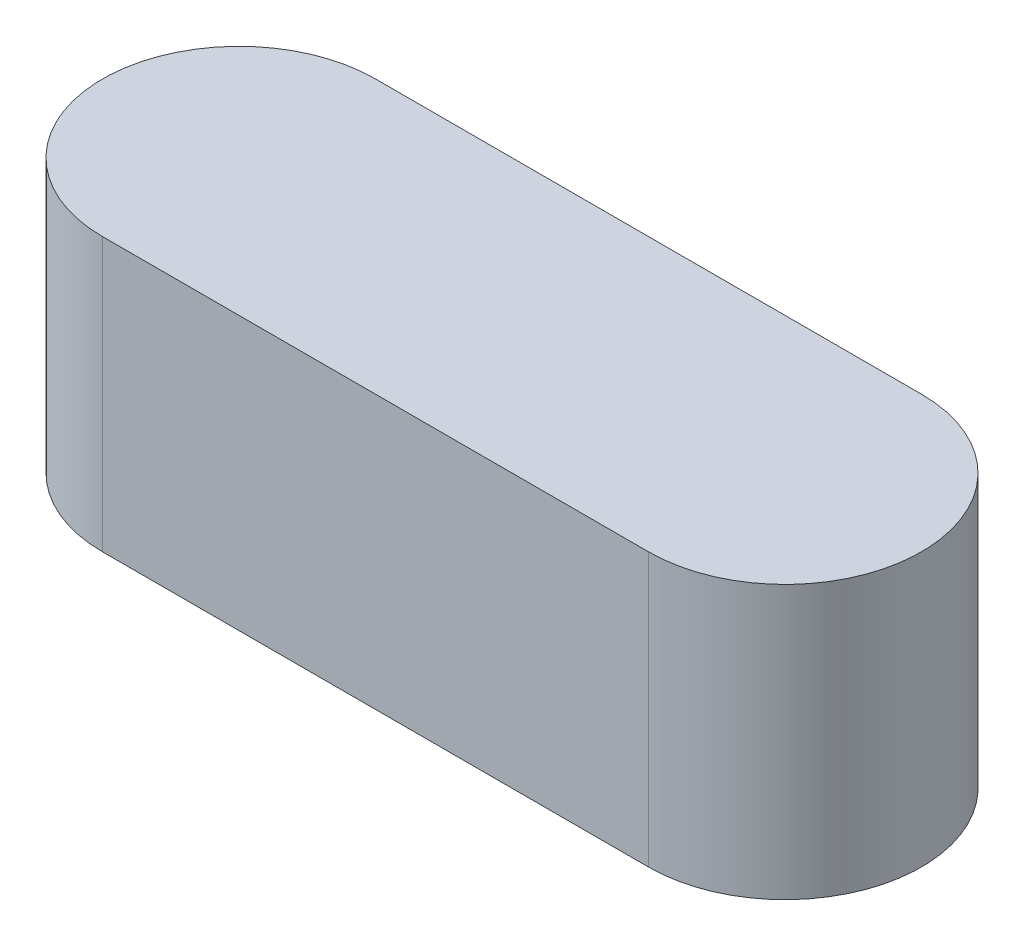
ISO-10303-21;
HEADER;
FILE_DESCRIPTION(('STEP AP214'),'2;1');
FILE_NAME('part.step','',(''),(''),'','','');
FILE_SCHEMA(('AUTOMOTIVE_DESIGN { 1 0 10303 214 1 1 1 1 }'));
ENDSEC;
DATA;
#1=APPLICATION_CONTEXT('core data for automotive mechanical design processes');
#2=APPLICATION_PROTOCOL_DEFINITION('international standard','automotive_design',2000,#1);
#3=PRODUCT_CONTEXT('',#1,'mechanical');
#4=PRODUCT('Part','Part','',(#3));
#5=PRODUCT_RELATED_PRODUCT_CATEGORY('part','',(#4));
#6=PRODUCT_DEFINITION_FORMATION('','',#4);
#7=PRODUCT_DEFINITION_CONTEXT('part definition',#1,'design');
#8=PRODUCT_DEFINITION('design','',#6,#7);
#9=PRODUCT_DEFINITION_SHAPE('','',#8);
#10=(LENGTH_UNIT() NAMED_UNIT(*) SI_UNIT(.MILLI.,.METRE.));
#11=(NAMED_UNIT(*) PLANE_ANGLE_UNIT() SI_UNIT($,.RADIAN.));
#12=(NAMED_UNIT(*) SI_UNIT($,.STERADIAN.) SOLID_ANGLE_UNIT());
#13=UNCERTAINTY_MEASURE_WITH_UNIT(LENGTH_MEASURE(1.E-05),#10,'distance_accuracy_value','');
#14=(GEOMETRIC_REPRESENTATION_CONTEXT(3) GLOBAL_UNCERTAINTY_ASSIGNED_CONTEXT((#13)) GLOBAL_UNIT_ASSIGNED_CONTEXT((#10,
#11,#12)) REPRESENTATION_CONTEXT('',''));
#15=CARTESIAN_POINT('',(0.,0.,0.));
#16=DIRECTION('',(0.,0.,1.));
#17=DIRECTION('',(1.,0.,0.));
#18=AXIS2_PLACEMENT_3D('',#15,#16,#17);
#19=CARTESIAN_POINT('',(-2.,8.32455532033676,0.));
#20=DIRECTION('',(0.,-1.,0.));
#21=DIRECTION('',(0.,0.,-1.));
#22=AXIS2_PLACEMENT_3D('',#19,#20,#21);
#23=CYLINDRICAL_SURFACE('',#22,1.);
#24=CARTESIAN_POINT('',(-2.,2.,0.));
#25=DIRECTION('',(0.,1.,0.));
#26=DIRECTION('',(0.,0.,1.));
#27=AXIS2_PLACEMENT_3D('',#24,#25,#26);
#28=CIRCLE('',#27,1.);
#29=CARTESIAN_POINT('',(-2.,2.,-1.));
#30=VERTEX_POINT('',#29);
#31=CARTESIAN_POINT('',(-2.,2.,1.));
#32=VERTEX_POINT('',#31);
#33=EDGE_CURVE('E83',#30,#32,#28,.T.);
#34=ORIENTED_EDGE('',*,*,#33,.F.);
#35=DIRECTION('',(0.,-1.,0.));
#36=VECTOR('',#35,1.);
#37=CARTESIAN_POINT('',(-2.,8.32455532033676,-1.));
#38=LINE('',#37,#36);
#39=CARTESIAN_POINT('',(-2.,0.,-1.));
#40=VERTEX_POINT('',#39);
#41=EDGE_CURVE('E37',#30,#40,#38,.T.);
#42=ORIENTED_EDGE('',*,*,#41,.T.);
#43=CARTESIAN_POINT('',(-2.,0.,0.));
#44=DIRECTION('',(0.,1.,0.));
#45=DIRECTION('',(0.,0.,1.));
#46=AXIS2_PLACEMENT_3D('',#43,#44,#45);
#47=CIRCLE('',#46,1.);
#48=CARTESIAN_POINT('',(-2.,0.,1.));
#49=VERTEX_POINT('',#48);
#50=EDGE_CURVE('E81',#40,#49,#47,.T.);
#51=ORIENTED_EDGE('',*,*,#50,.T.);
#52=DIRECTION('',(0.,-1.,0.));
#53=VECTOR('',#52,1.);
#54=CARTESIAN_POINT('',(-2.,8.32455532033676,1.));
#55=LINE('',#54,#53);
#56=EDGE_CURVE('E72',#32,#49,#55,.T.);
#57=ORIENTED_EDGE('',*,*,#56,.F.);
#58=EDGE_LOOP('',(#34,#42,#51,#57));
#59=FACE_BOUND('',#58,.T.);
#60=ADVANCED_FACE('F33',(#59),#23,.T.);
#61=CARTESIAN_POINT('',(-2.,8.32455532033676,1.));
#62=DIRECTION('',(0.,0.,-1.));
#63=DIRECTION('',(-1.,0.,0.));
#64=AXIS2_PLACEMENT_3D('',#61,#62,#63);
#65=PLANE('',#64);
#66=DIRECTION('',(1.,0.,0.));
#67=VECTOR('',#66,1.);
#68=CARTESIAN_POINT('',(-2.,2.,1.));
#69=LINE('',#68,#67);
#70=CARTESIAN_POINT('',(2.,2.,1.));
#71=VERTEX_POINT('',#70);
#72=EDGE_CURVE('E42',#32,#71,#69,.T.);
#73=ORIENTED_EDGE('',*,*,#72,.F.);
#74=ORIENTED_EDGE('',*,*,#56,.T.);
#75=DIRECTION('',(1.,0.,0.));
#76=VECTOR('',#75,1.);
#77=CARTESIAN_POINT('',(-2.,0.,1.));
#78=LINE('',#77,#76);
#79=CARTESIAN_POINT('',(2.,0.,1.));
#80=VERTEX_POINT('',#79);
#81=EDGE_CURVE('E93',#49,#80,#78,.T.);
#82=ORIENTED_EDGE('',*,*,#81,.T.);
#83=DIRECTION('',(0.,-1.,0.));
#84=VECTOR('',#83,1.);
#85=CARTESIAN_POINT('',(2.,8.32455532033676,1.));
#86=LINE('',#85,#84);
#87=EDGE_CURVE('E102',#71,#80,#86,.T.);
#88=ORIENTED_EDGE('',*,*,#87,.F.);
#89=EDGE_LOOP('',(#73,#74,#82,#88));
#90=FACE_BOUND('',#89,.T.);
#91=ADVANCED_FACE('F106',(#90),#65,.F.);
#92=CARTESIAN_POINT('',(2.,8.32455532033676,0.));
#93=DIRECTION('',(0.,-1.,0.));
#94=DIRECTION('',(0.,0.,-1.));
#95=AXIS2_PLACEMENT_3D('',#92,#93,#94);
#96=CYLINDRICAL_SURFACE('',#95,1.);
#97=CARTESIAN_POINT('',(2.,2.,0.));
#98=DIRECTION('',(0.,1.,0.));
#99=DIRECTION('',(0.,0.,1.));
#100=AXIS2_PLACEMENT_3D('',#97,#98,#99);
#101=CIRCLE('',#100,1.);
#102=CARTESIAN_POINT('',(2.,2.,-1.));
#103=VERTEX_POINT('',#102);
#104=EDGE_CURVE('E11',#71,#103,#101,.T.);
#105=ORIENTED_EDGE('',*,*,#104,.F.);
#106=ORIENTED_EDGE('',*,*,#87,.T.);
#107=CARTESIAN_POINT('',(2.,0.,0.));
#108=DIRECTION('',(0.,1.,0.));
#109=DIRECTION('',(0.,0.,1.));
#110=AXIS2_PLACEMENT_3D('',#107,#108,#109);
#111=CIRCLE('',#110,1.);
#112=CARTESIAN_POINT('',(2.,0.,-1.));
#113=VERTEX_POINT('',#112);
#114=EDGE_CURVE('E103',#80,#113,#111,.T.);
#115=ORIENTED_EDGE('',*,*,#114,.T.);
#116=DIRECTION('',(0.,-1.,0.));
#117=VECTOR('',#116,1.);
#118=CARTESIAN_POINT('',(2.,8.32455532033676,-1.));
#119=LINE('',#118,#117);
#120=EDGE_CURVE('E55',#103,#113,#119,.T.);
#121=ORIENTED_EDGE('',*,*,#120,.F.);
#122=EDGE_LOOP('',(#105,#106,#115,#121));
#123=FACE_BOUND('',#122,.T.);
#124=ADVANCED_FACE('F105',(#123),#96,.T.);
#125=CARTESIAN_POINT('',(2.,8.32455532033676,-1.));
#126=DIRECTION('',(0.,0.,1.));
#127=DIRECTION('',(1.,0.,0.));
#128=AXIS2_PLACEMENT_3D('',#125,#126,#127);
#129=PLANE('',#128);
#130=DIRECTION('',(-1.,0.,0.));
#131=VECTOR('',#130,1.);
#132=CARTESIAN_POINT('',(2.,2.,-1.));
#133=LINE('',#132,#131);
#134=EDGE_CURVE('E90',#103,#30,#133,.T.);
#135=ORIENTED_EDGE('',*,*,#134,.F.);
#136=ORIENTED_EDGE('',*,*,#120,.T.);
#137=DIRECTION('',(-1.,0.,0.));
#138=VECTOR('',#137,1.);
#139=CARTESIAN_POINT('',(2.,0.,-1.));
#140=LINE('',#139,#138);
#141=EDGE_CURVE('E86',#113,#40,#140,.T.);
#142=ORIENTED_EDGE('',*,*,#141,.T.);
#143=ORIENTED_EDGE('',*,*,#41,.F.);
#144=EDGE_LOOP('',(#135,#136,#142,#143));
#145=FACE_BOUND('',#144,.T.);
#146=ADVANCED_FACE('F87',(#145),#129,.F.);
#147=CARTESIAN_POINT('',(-2.,0.,0.));
#148=DIRECTION('',(0.,1.,0.));
#149=DIRECTION('',(0.,0.,1.));
#150=AXIS2_PLACEMENT_3D('',#147,#148,#149);
#151=PLANE('',#150);
#152=ORIENTED_EDGE('',*,*,#50,.F.);
#153=ORIENTED_EDGE('',*,*,#141,.F.);
#154=ORIENTED_EDGE('',*,*,#114,.F.);
#155=ORIENTED_EDGE('',*,*,#81,.F.);
#156=EDGE_LOOP('',(#152,#153,#154,#155));
#157=FACE_BOUND('',#156,.T.);
#158=ADVANCED_FACE('F92',(#157),#151,.F.);
#159=CARTESIAN_POINT('',(0.,2.,0.));
#160=DIRECTION('',(0.,1.,0.));
#161=DIRECTION('',(0.,0.,1.));
#162=AXIS2_PLACEMENT_3D('',#159,#160,#161);
#163=PLANE('',#162);
#164=ORIENTED_EDGE('',*,*,#134,.T.);
#165=ORIENTED_EDGE('',*,*,#33,.T.);
#166=ORIENTED_EDGE('',*,*,#72,.T.);
#167=ORIENTED_EDGE('',*,*,#104,.T.);
#168=EDGE_LOOP('',(#164,#165,#166,#167));
#169=FACE_BOUND('',#168,.T.);
#170=ADVANCED_FACE('F35',(#169),#163,.T.);
#171=CLOSED_SHELL('',(#60,#91,#124,#146,#158,#170));
#172=MANIFOLD_SOLID_BREP('B2',#171);
#173=ADVANCED_BREP_SHAPE_REPRESENTATION('',(#18,#172),#14);
#174=SHAPE_DEFINITION_REPRESENTATION(#9,#173);
ENDSEC;
END-ISO-10303-21;
